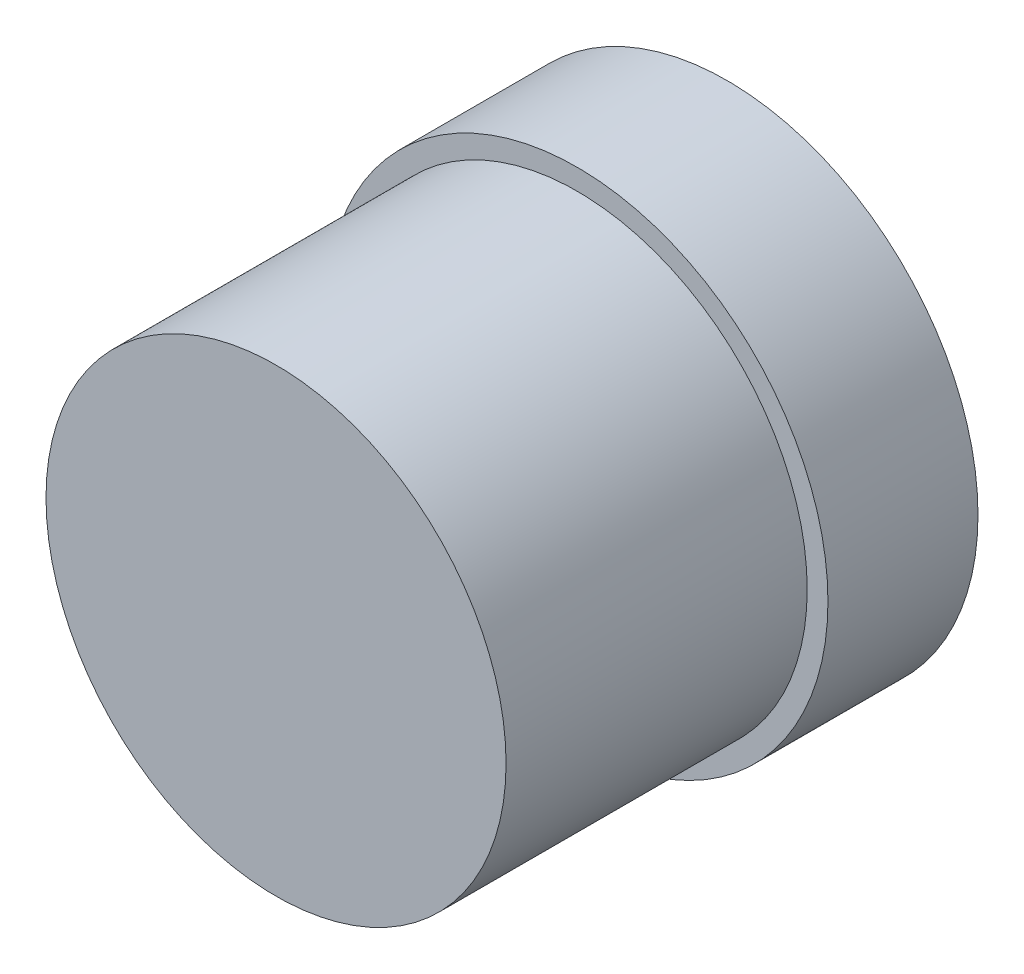
ISO-10303-21;
HEADER;
FILE_DESCRIPTION(('STEP AP214'),'2;1');
FILE_NAME('part.step','',(''),(''),'','','');
FILE_SCHEMA(('AUTOMOTIVE_DESIGN { 1 0 10303 214 1 1 1 1 }'));
ENDSEC;
DATA;
#1=APPLICATION_CONTEXT('core data for automotive mechanical design processes');
#2=APPLICATION_PROTOCOL_DEFINITION('international standard','automotive_design',2000,#1);
#3=PRODUCT_CONTEXT('',#1,'mechanical');
#4=PRODUCT('Part','Part','',(#3));
#5=PRODUCT_RELATED_PRODUCT_CATEGORY('part','',(#4));
#6=PRODUCT_DEFINITION_FORMATION('','',#4);
#7=PRODUCT_DEFINITION_CONTEXT('part definition',#1,'design');
#8=PRODUCT_DEFINITION('design','',#6,#7);
#9=PRODUCT_DEFINITION_SHAPE('','',#8);
#10=(LENGTH_UNIT() NAMED_UNIT(*) SI_UNIT(.MILLI.,.METRE.));
#11=(NAMED_UNIT(*) PLANE_ANGLE_UNIT() SI_UNIT($,.RADIAN.));
#12=(NAMED_UNIT(*) SI_UNIT($,.STERADIAN.) SOLID_ANGLE_UNIT());
#13=UNCERTAINTY_MEASURE_WITH_UNIT(LENGTH_MEASURE(1.E-05),#10,'distance_accuracy_value','');
#14=(GEOMETRIC_REPRESENTATION_CONTEXT(3) GLOBAL_UNCERTAINTY_ASSIGNED_CONTEXT((#13)) GLOBAL_UNIT_ASSIGNED_CONTEXT((#10,
#11,#12)) REPRESENTATION_CONTEXT('',''));
#15=CARTESIAN_POINT('',(0.,0.,0.));
#16=DIRECTION('',(0.,0.,1.));
#17=DIRECTION('',(1.,0.,0.));
#18=AXIS2_PLACEMENT_3D('',#15,#16,#17);
#19=CARTESIAN_POINT('',(0.,0.,68.5));
#20=DIRECTION('',(0.,0.,-1.));
#21=DIRECTION('',(-1.,0.,0.));
#22=AXIS2_PLACEMENT_3D('',#19,#20,#21);
#23=CYLINDRICAL_SURFACE('',#22,38.075);
#24=CARTESIAN_POINT('',(0.,0.,0.));
#25=DIRECTION('',(0.,0.,1.));
#26=DIRECTION('',(1.,0.,0.));
#27=AXIS2_PLACEMENT_3D('',#24,#25,#26);
#28=CIRCLE('',#27,38.075);
#29=CARTESIAN_POINT('',(38.075,0.,0.));
#30=VERTEX_POINT('',#29);
#31=EDGE_CURVE('E60',#30,#30,#28,.T.);
#32=ORIENTED_EDGE('',*,*,#31,.T.);
#33=EDGE_LOOP('',(#32));
#34=FACE_BOUND('',#33,.T.);
#35=CARTESIAN_POINT('',(0.,0.,22.78));
#36=DIRECTION('',(0.,0.,1.));
#37=DIRECTION('',(1.,0.,0.));
#38=AXIS2_PLACEMENT_3D('',#35,#36,#37);
#39=CIRCLE('',#38,38.075);
#40=CARTESIAN_POINT('',(38.075,0.,22.78));
#41=VERTEX_POINT('',#40);
#42=EDGE_CURVE('E65',#41,#41,#39,.T.);
#43=ORIENTED_EDGE('',*,*,#42,.F.);
#44=EDGE_LOOP('',(#43));
#45=FACE_BOUND('',#44,.T.);
#46=ADVANCED_FACE('F47',(#34,#45),#23,.T.);
#47=CARTESIAN_POINT('',(0.,0.,0.));
#48=DIRECTION('',(0.,0.,1.));
#49=DIRECTION('',(1.,0.,0.));
#50=AXIS2_PLACEMENT_3D('',#47,#48,#49);
#51=PLANE('',#50);
#52=CARTESIAN_POINT('',(0.,0.,0.));
#53=DIRECTION('',(0.,0.,-1.));
#54=DIRECTION('',(-1.,0.,0.));
#55=AXIS2_PLACEMENT_3D('',#52,#53,#54);
#56=CIRCLE('',#55,21.075);
#57=CARTESIAN_POINT('',(-21.075,0.,0.));
#58=VERTEX_POINT('',#57);
#59=EDGE_CURVE('E55',#58,#58,#56,.T.);
#60=ORIENTED_EDGE('',*,*,#59,.F.);
#61=EDGE_LOOP('',(#60));
#62=FACE_BOUND('',#61,.T.);
#63=ORIENTED_EDGE('',*,*,#31,.F.);
#64=EDGE_LOOP('',(#63));
#65=FACE_BOUND('',#64,.T.);
#66=ADVANCED_FACE('F90',(#62,#65),#51,.F.);
#67=CARTESIAN_POINT('',(0.,0.,3.));
#68=DIRECTION('',(0.,0.,-1.));
#69=DIRECTION('',(-1.,0.,0.));
#70=AXIS2_PLACEMENT_3D('',#67,#68,#69);
#71=CYLINDRICAL_SURFACE('',#70,21.075);
#72=CARTESIAN_POINT('',(0.,0.,3.));
#73=DIRECTION('',(0.,0.,-1.));
#74=DIRECTION('',(-1.,0.,0.));
#75=AXIS2_PLACEMENT_3D('',#72,#73,#74);
#76=CIRCLE('',#75,21.075);
#77=CARTESIAN_POINT('',(-21.075,0.,3.));
#78=VERTEX_POINT('',#77);
#79=EDGE_CURVE('E11',#78,#78,#76,.T.);
#80=ORIENTED_EDGE('',*,*,#79,.F.);
#81=EDGE_LOOP('',(#80));
#82=FACE_BOUND('',#81,.T.);
#83=ORIENTED_EDGE('',*,*,#59,.T.);
#84=EDGE_LOOP('',(#83));
#85=FACE_BOUND('',#84,.T.);
#86=ADVANCED_FACE('F96',(#82,#85),#71,.F.);
#87=CARTESIAN_POINT('',(0.,0.,3.));
#88=DIRECTION('',(0.,0.,-1.));
#89=DIRECTION('',(-1.,0.,0.));
#90=AXIS2_PLACEMENT_3D('',#87,#88,#89);
#91=PLANE('',#90);
#92=ORIENTED_EDGE('',*,*,#79,.T.);
#93=EDGE_LOOP('',(#92));
#94=FACE_BOUND('',#93,.T.);
#95=ADVANCED_FACE('F49',(#94),#91,.T.);
#96=CARTESIAN_POINT('',(0.,0.,22.78));
#97=DIRECTION('',(0.,0.,1.));
#98=DIRECTION('',(1.,0.,0.));
#99=AXIS2_PLACEMENT_3D('',#96,#97,#98);
#100=PLANE('',#99);
#101=CARTESIAN_POINT('',(0.,0.,22.78));
#102=DIRECTION('',(0.,0.,1.));
#103=DIRECTION('',(1.,0.,0.));
#104=AXIS2_PLACEMENT_3D('',#101,#102,#103);
#105=CIRCLE('',#104,34.925);
#106=CARTESIAN_POINT('',(34.925,0.,22.78));
#107=VERTEX_POINT('',#106);
#108=EDGE_CURVE('E71',#107,#107,#105,.T.);
#109=ORIENTED_EDGE('',*,*,#108,.F.);
#110=EDGE_LOOP('',(#109));
#111=FACE_BOUND('',#110,.T.);
#112=ORIENTED_EDGE('',*,*,#42,.T.);
#113=EDGE_LOOP('',(#112));
#114=FACE_BOUND('',#113,.T.);
#115=ADVANCED_FACE('F83',(#111,#114),#100,.T.);
#116=CARTESIAN_POINT('',(0.,0.,22.78));
#117=DIRECTION('',(0.,0.,1.));
#118=DIRECTION('',(1.,0.,0.));
#119=AXIS2_PLACEMENT_3D('',#116,#117,#118);
#120=CYLINDRICAL_SURFACE('',#119,34.925);
#121=ORIENTED_EDGE('',*,*,#108,.T.);
#122=EDGE_LOOP('',(#121));
#123=FACE_BOUND('',#122,.T.);
#124=CARTESIAN_POINT('',(0.,0.,68.5));
#125=DIRECTION('',(0.,0.,1.));
#126=DIRECTION('',(1.,0.,0.));
#127=AXIS2_PLACEMENT_3D('',#124,#125,#126);
#128=CIRCLE('',#127,34.925);
#129=CARTESIAN_POINT('',(34.925,0.,68.5));
#130=VERTEX_POINT('',#129);
#131=EDGE_CURVE('E72',#130,#130,#128,.T.);
#132=ORIENTED_EDGE('',*,*,#131,.F.);
#133=EDGE_LOOP('',(#132));
#134=FACE_BOUND('',#133,.T.);
#135=ADVANCED_FACE('F80',(#123,#134),#120,.T.);
#136=CARTESIAN_POINT('',(0.,0.,68.5));
#137=DIRECTION('',(0.,0.,1.));
#138=DIRECTION('',(1.,0.,0.));
#139=AXIS2_PLACEMENT_3D('',#136,#137,#138);
#140=PLANE('',#139);
#141=ORIENTED_EDGE('',*,*,#131,.T.);
#142=EDGE_LOOP('',(#141));
#143=FACE_BOUND('',#142,.T.);
#144=ADVANCED_FACE('F101',(#143),#140,.T.);
#145=CLOSED_SHELL('',(#46,#66,#86,#95,#115,#135,#144));
#146=MANIFOLD_SOLID_BREP('B2',#145);
#147=CARTESIAN_POINT('',(0.,0.,-6.));
#148=DIRECTION('',(0.,0.,-1.));
#149=DIRECTION('',(-1.,0.,0.));
#150=AXIS2_PLACEMENT_3D('',#147,#148,#149);
#151=PLANE('',#150);
#152=CARTESIAN_POINT('',(0.,0.,-6.));
#153=DIRECTION('',(0.,0.,-1.));
#154=DIRECTION('',(-1.,0.,0.));
#155=AXIS2_PLACEMENT_3D('',#152,#153,#154);
#156=CIRCLE('',#155,9.50000000000001);
#157=CARTESIAN_POINT('',(-9.50000000000001,0.,-6.));
#158=VERTEX_POINT('',#157);
#159=EDGE_CURVE('E162',#158,#158,#156,.T.);
#160=ORIENTED_EDGE('',*,*,#159,.T.);
#161=EDGE_LOOP('',(#160));
#162=FACE_BOUND('',#161,.T.);
#163=ADVANCED_FACE('F154',(#162),#151,.T.);
#164=CARTESIAN_POINT('',(0.,0.,-6.));
#165=DIRECTION('',(0.,0.,1.));
#166=DIRECTION('',(1.,0.,0.));
#167=AXIS2_PLACEMENT_3D('',#164,#165,#166);
#168=CONICAL_SURFACE('',#167,9.50000000000001,0.785398163397449);
#169=CARTESIAN_POINT('',(0.,0.,-4.00000000000001));
#170=DIRECTION('',(0.,0.,-1.));
#171=DIRECTION('',(-1.,0.,0.));
#172=AXIS2_PLACEMENT_3D('',#169,#170,#171);
#173=CIRCLE('',#172,11.5);
#174=CARTESIAN_POINT('',(-11.5,0.,-4.00000000000001));
#175=VERTEX_POINT('',#174);
#176=EDGE_CURVE('E46',#175,#175,#173,.F.);
#177=ORIENTED_EDGE('',*,*,#176,.F.);
#178=EDGE_LOOP('',(#177));
#179=FACE_BOUND('',#178,.T.);
#180=ORIENTED_EDGE('',*,*,#159,.F.);
#181=EDGE_LOOP('',(#180));
#182=FACE_BOUND('',#181,.T.);
#183=ADVANCED_FACE('F157',(#179,#182),#168,.T.);
#184=CARTESIAN_POINT('',(0.,0.,-6.));
#185=DIRECTION('',(0.,0.,1.));
#186=DIRECTION('',(1.,0.,0.));
#187=AXIS2_PLACEMENT_3D('',#184,#185,#186);
#188=CYLINDRICAL_SURFACE('',#187,11.5);
#189=ORIENTED_EDGE('',*,*,#176,.T.);
#190=EDGE_LOOP('',(#189));
#191=FACE_BOUND('',#190,.T.);
#192=CARTESIAN_POINT('',(0.,0.,0.));
#193=DIRECTION('',(0.,0.,-1.));
#194=DIRECTION('',(-1.,0.,0.));
#195=AXIS2_PLACEMENT_3D('',#192,#193,#194);
#196=CIRCLE('',#195,11.5);
#197=CARTESIAN_POINT('',(-11.5,0.,0.));
#198=VERTEX_POINT('',#197);
#199=EDGE_CURVE('E166',#198,#198,#196,.T.);
#200=ORIENTED_EDGE('',*,*,#199,.T.);
#201=EDGE_LOOP('',(#200));
#202=FACE_BOUND('',#201,.T.);
#203=ADVANCED_FACE('F173',(#191,#202),#188,.T.);
#204=CARTESIAN_POINT('',(0.,0.,0.));
#205=DIRECTION('',(0.,0.,-1.));
#206=DIRECTION('',(-1.,0.,0.));
#207=AXIS2_PLACEMENT_3D('',#204,#205,#206);
#208=PLANE('',#207);
#209=ORIENTED_EDGE('',*,*,#199,.F.);
#210=EDGE_LOOP('',(#209));
#211=FACE_BOUND('',#210,.T.);
#212=ADVANCED_FACE('F175',(#211),#208,.F.);
#213=CLOSED_SHELL('',(#163,#183,#203,#212));
#214=MANIFOLD_SOLID_BREP('B6',#213);
#215=ADVANCED_BREP_SHAPE_REPRESENTATION('',(#18,#146,#214),#14);
#216=SHAPE_DEFINITION_REPRESENTATION(#9,#215);
ENDSEC;
END-ISO-10303-21;
